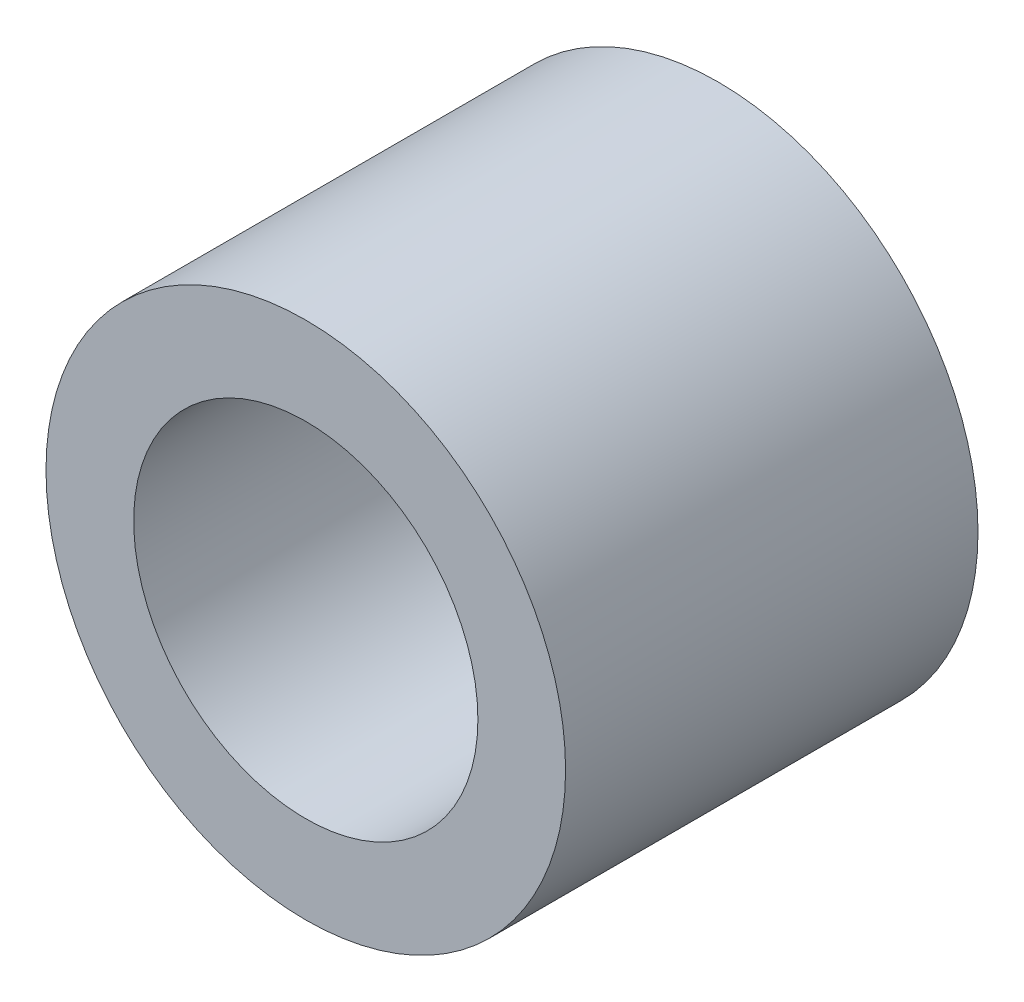
ISO-10303-21;
HEADER;
FILE_DESCRIPTION(('STEP AP214'),'2;1');
FILE_NAME('part.step','',(''),(''),'','','');
FILE_SCHEMA(('AUTOMOTIVE_DESIGN { 1 0 10303 214 1 1 1 1 }'));
ENDSEC;
DATA;
#1=APPLICATION_CONTEXT('core data for automotive mechanical design processes');
#2=APPLICATION_PROTOCOL_DEFINITION('international standard','automotive_design',2000,#1);
#3=PRODUCT_CONTEXT('',#1,'mechanical');
#4=PRODUCT('Part','Part','',(#3));
#5=PRODUCT_RELATED_PRODUCT_CATEGORY('part','',(#4));
#6=PRODUCT_DEFINITION_FORMATION('','',#4);
#7=PRODUCT_DEFINITION_CONTEXT('part definition',#1,'design');
#8=PRODUCT_DEFINITION('design','',#6,#7);
#9=PRODUCT_DEFINITION_SHAPE('','',#8);
#10=(LENGTH_UNIT() NAMED_UNIT(*) SI_UNIT(.MILLI.,.METRE.));
#11=(NAMED_UNIT(*) PLANE_ANGLE_UNIT() SI_UNIT($,.RADIAN.));
#12=(NAMED_UNIT(*) SI_UNIT($,.STERADIAN.) SOLID_ANGLE_UNIT());
#13=UNCERTAINTY_MEASURE_WITH_UNIT(LENGTH_MEASURE(1.E-05),#10,'distance_accuracy_value','');
#14=(GEOMETRIC_REPRESENTATION_CONTEXT(3) GLOBAL_UNCERTAINTY_ASSIGNED_CONTEXT((#13)) GLOBAL_UNIT_ASSIGNED_CONTEXT((#10,
#11,#12)) REPRESENTATION_CONTEXT('',''));
#15=CARTESIAN_POINT('',(0.,0.,0.));
#16=DIRECTION('',(0.,0.,1.));
#17=DIRECTION('',(1.,0.,0.));
#18=AXIS2_PLACEMENT_3D('',#15,#16,#17);
#19=CARTESIAN_POINT('',(0.,0.,3.175));
#20=DIRECTION('',(0.,0.,1.));
#21=DIRECTION('',(1.,0.,0.));
#22=AXIS2_PLACEMENT_3D('',#19,#20,#21);
#23=PLANE('',#22);
#24=CARTESIAN_POINT('',(0.,0.,3.175));
#25=DIRECTION('',(0.,0.,1.));
#26=DIRECTION('',(1.,0.,0.));
#27=AXIS2_PLACEMENT_3D('',#24,#25,#26);
#28=CIRCLE('',#27,4.);
#29=CARTESIAN_POINT('',(4.,0.,3.175));
#30=VERTEX_POINT('',#29);
#31=EDGE_CURVE('E10',#30,#30,#28,.T.);
#32=ORIENTED_EDGE('',*,*,#31,.T.);
#33=EDGE_LOOP('',(#32));
#34=FACE_BOUND('',#33,.T.);
#35=CARTESIAN_POINT('',(0.,0.,3.175));
#36=DIRECTION('',(0.,0.,1.));
#37=DIRECTION('',(1.,0.,0.));
#38=AXIS2_PLACEMENT_3D('',#35,#36,#37);
#39=CIRCLE('',#38,2.65);
#40=CARTESIAN_POINT('',(2.65,0.,3.175));
#41=VERTEX_POINT('',#40);
#42=EDGE_CURVE('E41',#41,#41,#39,.T.);
#43=ORIENTED_EDGE('',*,*,#42,.F.);
#44=EDGE_LOOP('',(#43));
#45=FACE_BOUND('',#44,.T.);
#46=ADVANCED_FACE('F30',(#34,#45),#23,.T.);
#47=CARTESIAN_POINT('',(0.,0.,-3.175));
#48=DIRECTION('',(0.,0.,1.));
#49=DIRECTION('',(1.,0.,0.));
#50=AXIS2_PLACEMENT_3D('',#47,#48,#49);
#51=PLANE('',#50);
#52=CARTESIAN_POINT('',(0.,0.,-3.175));
#53=DIRECTION('',(0.,0.,1.));
#54=DIRECTION('',(1.,0.,0.));
#55=AXIS2_PLACEMENT_3D('',#52,#53,#54);
#56=CIRCLE('',#55,4.);
#57=CARTESIAN_POINT('',(4.,0.,-3.175));
#58=VERTEX_POINT('',#57);
#59=EDGE_CURVE('E34',#58,#58,#56,.T.);
#60=ORIENTED_EDGE('',*,*,#59,.F.);
#61=EDGE_LOOP('',(#60));
#62=FACE_BOUND('',#61,.T.);
#63=CARTESIAN_POINT('',(0.,0.,-3.175));
#64=DIRECTION('',(0.,0.,1.));
#65=DIRECTION('',(1.,0.,0.));
#66=AXIS2_PLACEMENT_3D('',#63,#64,#65);
#67=CIRCLE('',#66,2.65);
#68=CARTESIAN_POINT('',(2.65,0.,-3.175));
#69=VERTEX_POINT('',#68);
#70=EDGE_CURVE('E43',#69,#69,#67,.T.);
#71=ORIENTED_EDGE('',*,*,#70,.T.);
#72=EDGE_LOOP('',(#71));
#73=FACE_BOUND('',#72,.T.);
#74=ADVANCED_FACE('F53',(#62,#73),#51,.F.);
#75=CARTESIAN_POINT('',(0.,0.,3.175));
#76=DIRECTION('',(0.,0.,-1.));
#77=DIRECTION('',(-1.,0.,0.));
#78=AXIS2_PLACEMENT_3D('',#75,#76,#77);
#79=CYLINDRICAL_SURFACE('',#78,4.);
#80=ORIENTED_EDGE('',*,*,#31,.F.);
#81=EDGE_LOOP('',(#80));
#82=FACE_BOUND('',#81,.T.);
#83=ORIENTED_EDGE('',*,*,#59,.T.);
#84=EDGE_LOOP('',(#83));
#85=FACE_BOUND('',#84,.T.);
#86=ADVANCED_FACE('F32',(#82,#85),#79,.T.);
#87=CARTESIAN_POINT('',(0.,0.,3.175));
#88=DIRECTION('',(0.,0.,-1.));
#89=DIRECTION('',(-1.,0.,0.));
#90=AXIS2_PLACEMENT_3D('',#87,#88,#89);
#91=CYLINDRICAL_SURFACE('',#90,2.65);
#92=ORIENTED_EDGE('',*,*,#42,.T.);
#93=EDGE_LOOP('',(#92));
#94=FACE_BOUND('',#93,.T.);
#95=ORIENTED_EDGE('',*,*,#70,.F.);
#96=EDGE_LOOP('',(#95));
#97=FACE_BOUND('',#96,.T.);
#98=ADVANCED_FACE('F49',(#94,#97),#91,.F.);
#99=CLOSED_SHELL('',(#46,#74,#86,#98));
#100=MANIFOLD_SOLID_BREP('B2',#99);
#101=ADVANCED_BREP_SHAPE_REPRESENTATION('',(#18,#100),#14);
#102=SHAPE_DEFINITION_REPRESENTATION(#9,#101);
ENDSEC;
END-ISO-10303-21;
